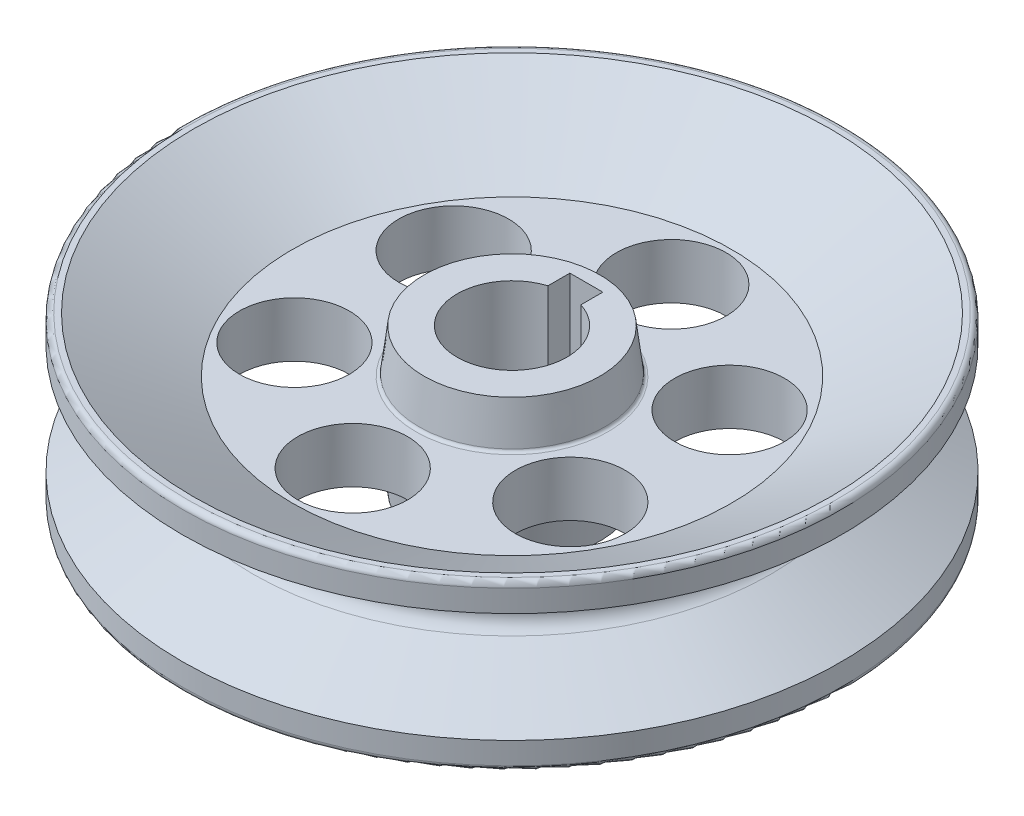
ISO-10303-21;
HEADER;
FILE_DESCRIPTION(('STEP AP214'),'2;1');
FILE_NAME('part.step','',(''),(''),'','','');
FILE_SCHEMA(('AUTOMOTIVE_DESIGN { 1 0 10303 214 1 1 1 1 }'));
ENDSEC;
DATA;
#1=APPLICATION_CONTEXT('core data for automotive mechanical design processes');
#2=APPLICATION_PROTOCOL_DEFINITION('international standard','automotive_design',2000,#1);
#3=PRODUCT_CONTEXT('',#1,'mechanical');
#4=PRODUCT('Part','Part','',(#3));
#5=PRODUCT_RELATED_PRODUCT_CATEGORY('part','',(#4));
#6=PRODUCT_DEFINITION_FORMATION('','',#4);
#7=PRODUCT_DEFINITION_CONTEXT('part definition',#1,'design');
#8=PRODUCT_DEFINITION('design','',#6,#7);
#9=PRODUCT_DEFINITION_SHAPE('','',#8);
#10=(LENGTH_UNIT() NAMED_UNIT(*) SI_UNIT(.MILLI.,.METRE.));
#11=(NAMED_UNIT(*) PLANE_ANGLE_UNIT() SI_UNIT($,.RADIAN.));
#12=(NAMED_UNIT(*) SI_UNIT($,.STERADIAN.) SOLID_ANGLE_UNIT());
#13=UNCERTAINTY_MEASURE_WITH_UNIT(LENGTH_MEASURE(1.E-05),#10,'distance_accuracy_value','');
#14=(GEOMETRIC_REPRESENTATION_CONTEXT(3) GLOBAL_UNCERTAINTY_ASSIGNED_CONTEXT((#13)) GLOBAL_UNIT_ASSIGNED_CONTEXT((#10,
#11,#12)) REPRESENTATION_CONTEXT('',''));
#15=CARTESIAN_POINT('',(0.,0.,0.));
#16=DIRECTION('',(0.,0.,1.));
#17=DIRECTION('',(1.,0.,0.));
#18=AXIS2_PLACEMENT_3D('',#15,#16,#17);
#19=CARTESIAN_POINT('',(0.,-381.,0.));
#20=DIRECTION('',(0.,1.,0.));
#21=DIRECTION('',(0.,0.,1.));
#22=AXIS2_PLACEMENT_3D('',#19,#20,#21);
#23=CYLINDRICAL_SURFACE('',#22,254.);
#24=CARTESIAN_POINT('',(0.,330.2,0.));
#25=DIRECTION('',(0.,1.,0.));
#26=DIRECTION('',(0.,0.,1.));
#27=AXIS2_PLACEMENT_3D('',#24,#25,#26);
#28=CIRCLE('',#27,254.);
#29=CARTESIAN_POINT('',(76.2,330.2,-242.300557159904));
#30=VERTEX_POINT('',#29);
#31=CARTESIAN_POINT('',(-76.2,330.2,-242.300557159891));
#32=VERTEX_POINT('',#31);
#33=EDGE_CURVE('E86',#30,#32,#28,.F.);
#34=ORIENTED_EDGE('',*,*,#33,.F.);
#35=DIRECTION('',(0.,1.,0.));
#36=VECTOR('',#35,1.);
#37=CARTESIAN_POINT('',(76.1999999999998,-381.,-242.300557159904));
#38=LINE('',#37,#36);
#39=CARTESIAN_POINT('',(76.2,-330.2,-242.300557159891));
#40=VERTEX_POINT('',#39);
#41=EDGE_CURVE('E98',#40,#30,#38,.T.);
#42=ORIENTED_EDGE('',*,*,#41,.F.);
#43=CARTESIAN_POINT('',(0.,-330.2,1.33226762955019E-11));
#44=DIRECTION('',(0.,-1.,0.));
#45=DIRECTION('',(0.,0.,-1.));
#46=AXIS2_PLACEMENT_3D('',#43,#44,#45);
#47=CIRCLE('',#46,254.);
#48=CARTESIAN_POINT('',(-76.2,-330.2,-242.300557159878));
#49=VERTEX_POINT('',#48);
#50=EDGE_CURVE('E68',#49,#40,#47,.F.);
#51=ORIENTED_EDGE('',*,*,#50,.F.);
#52=DIRECTION('',(0.,1.,0.));
#53=VECTOR('',#52,1.);
#54=CARTESIAN_POINT('',(-76.2,-381.,-242.300557159891));
#55=LINE('',#54,#53);
#56=EDGE_CURVE('E100',#49,#32,#55,.T.);
#57=ORIENTED_EDGE('',*,*,#56,.T.);
#58=EDGE_LOOP('',(#34,#42,#51,#57));
#59=FACE_BOUND('',#58,.T.);
#60=ADVANCED_FACE('F45',(#59),#23,.F.);
#61=CARTESIAN_POINT('',(-76.2,-381.,-242.300557159891));
#62=DIRECTION('',(-1.,0.,0.));
#63=DIRECTION('',(0.,0.,1.));
#64=AXIS2_PLACEMENT_3D('',#61,#62,#63);
#65=PLANE('',#64);
#66=DIRECTION('',(0.,0.,-1.));
#67=VECTOR('',#66,1.);
#68=CARTESIAN_POINT('',(-76.2,330.2,-242.300557159891));
#69=LINE('',#68,#67);
#70=CARTESIAN_POINT('',(-76.2,330.2,-343.900557159904));
#71=VERTEX_POINT('',#70);
#72=EDGE_CURVE('E102',#32,#71,#69,.T.);
#73=ORIENTED_EDGE('',*,*,#72,.F.);
#74=ORIENTED_EDGE('',*,*,#56,.F.);
#75=DIRECTION('',(0.,0.,1.));
#76=VECTOR('',#75,1.);
#77=CARTESIAN_POINT('',(-76.2,-330.2,-242.300557159878));
#78=LINE('',#77,#76);
#79=CARTESIAN_POINT('',(-76.1999999999998,-330.199999999993,-343.900557159904));
#80=VERTEX_POINT('',#79);
#81=EDGE_CURVE('E109',#80,#49,#78,.T.);
#82=ORIENTED_EDGE('',*,*,#81,.F.);
#83=DIRECTION('',(0.,1.,0.));
#84=VECTOR('',#83,1.);
#85=CARTESIAN_POINT('',(-76.2,-380.999999999993,-343.900557159904));
#86=LINE('',#85,#84);
#87=EDGE_CURVE('E107',#80,#71,#86,.T.);
#88=ORIENTED_EDGE('',*,*,#87,.T.);
#89=EDGE_LOOP('',(#73,#74,#82,#88));
#90=FACE_BOUND('',#89,.T.);
#91=ADVANCED_FACE('F156',(#90),#65,.F.);
#92=CARTESIAN_POINT('',(-76.2,-380.999999999993,-343.900557159904));
#93=DIRECTION('',(0.,0.,-1.));
#94=DIRECTION('',(-1.,0.,0.));
#95=AXIS2_PLACEMENT_3D('',#92,#93,#94);
#96=PLANE('',#95);
#97=DIRECTION('',(1.,0.,0.));
#98=VECTOR('',#97,1.);
#99=CARTESIAN_POINT('',(-76.2,330.2,-343.900557159904));
#100=LINE('',#99,#98);
#101=CARTESIAN_POINT('',(76.2,330.2,-343.900557159877));
#102=VERTEX_POINT('',#101);
#103=EDGE_CURVE('E60',#71,#102,#100,.T.);
#104=ORIENTED_EDGE('',*,*,#103,.F.);
#105=ORIENTED_EDGE('',*,*,#87,.F.);
#106=DIRECTION('',(-1.,0.,0.));
#107=VECTOR('',#106,1.);
#108=CARTESIAN_POINT('',(-76.1999999999998,-330.199999999993,-343.900557159904));
#109=LINE('',#108,#107);
#110=CARTESIAN_POINT('',(76.2,-330.199999999994,-343.900557159903));
#111=VERTEX_POINT('',#110);
#112=EDGE_CURVE('E247',#111,#80,#109,.T.);
#113=ORIENTED_EDGE('',*,*,#112,.F.);
#114=DIRECTION('',(0.,1.,0.));
#115=VECTOR('',#114,1.);
#116=CARTESIAN_POINT('',(76.2,-380.999999999993,-343.900557159904));
#117=LINE('',#116,#115);
#118=EDGE_CURVE('E105',#111,#102,#117,.T.);
#119=ORIENTED_EDGE('',*,*,#118,.T.);
#120=EDGE_LOOP('',(#104,#105,#113,#119));
#121=FACE_BOUND('',#120,.T.);
#122=ADVANCED_FACE('F161',(#121),#96,.F.);
#123=CARTESIAN_POINT('',(76.2,-380.999999999993,-343.900557159904));
#124=DIRECTION('',(1.,0.,0.));
#125=DIRECTION('',(0.,0.,-1.));
#126=AXIS2_PLACEMENT_3D('',#123,#124,#125);
#127=PLANE('',#126);
#128=DIRECTION('',(0.,0.,1.));
#129=VECTOR('',#128,1.);
#130=CARTESIAN_POINT('',(76.2,330.2,-343.900557159877));
#131=LINE('',#130,#129);
#132=EDGE_CURVE('E83',#102,#30,#131,.T.);
#133=ORIENTED_EDGE('',*,*,#132,.F.);
#134=ORIENTED_EDGE('',*,*,#118,.F.);
#135=DIRECTION('',(0.,0.,-1.));
#136=VECTOR('',#135,1.);
#137=CARTESIAN_POINT('',(76.2,-330.199999999994,-343.900557159903));
#138=LINE('',#137,#136);
#139=EDGE_CURVE('E93',#40,#111,#138,.T.);
#140=ORIENTED_EDGE('',*,*,#139,.F.);
#141=ORIENTED_EDGE('',*,*,#41,.T.);
#142=EDGE_LOOP('',(#133,#134,#140,#141));
#143=FACE_BOUND('',#142,.T.);
#144=ADVANCED_FACE('F104',(#143),#127,.F.);
#145=CARTESIAN_POINT('',(0.,-381.,-736.599999999999));
#146=DIRECTION('',(0.,1.,0.));
#147=DIRECTION('',(0.,0.,1.));
#148=AXIS2_PLACEMENT_3D('',#145,#146,#147);
#149=CYLINDRICAL_SURFACE('',#148,254.);
#150=CARTESIAN_POINT('',(0.,-127.,-736.6));
#151=DIRECTION('',(0.,-1.,0.));
#152=DIRECTION('',(0.,0.,-1.));
#153=AXIS2_PLACEMENT_3D('',#150,#151,#152);
#154=CIRCLE('',#153,254.);
#155=CARTESIAN_POINT('',(0.,-127.,-990.6));
#156=VERTEX_POINT('',#155);
#157=EDGE_CURVE('E249',#156,#156,#154,.F.);
#158=ORIENTED_EDGE('',*,*,#157,.F.);
#159=EDGE_LOOP('',(#158));
#160=FACE_BOUND('',#159,.T.);
#161=CARTESIAN_POINT('',(0.,127.,-736.599999999999));
#162=DIRECTION('',(0.,1.,0.));
#163=DIRECTION('',(0.,0.,1.));
#164=AXIS2_PLACEMENT_3D('',#161,#162,#163);
#165=CIRCLE('',#164,254.);
#166=CARTESIAN_POINT('',(0.,127.,-482.599999999999));
#167=VERTEX_POINT('',#166);
#168=EDGE_CURVE('E241',#167,#167,#165,.F.);
#169=ORIENTED_EDGE('',*,*,#168,.F.);
#170=EDGE_LOOP('',(#169));
#171=FACE_BOUND('',#170,.T.);
#172=ADVANCED_FACE('F229',(#160,#171),#149,.F.);
#173=CARTESIAN_POINT('',(-637.914312427618,-381.,-368.299999999998));
#174=DIRECTION('',(0.,1.,0.));
#175=DIRECTION('',(0.,0.,1.));
#176=AXIS2_PLACEMENT_3D('',#173,#174,#175);
#177=CYLINDRICAL_SURFACE('',#176,254.);
#178=CARTESIAN_POINT('',(-637.914312427618,-127.,-368.299999999997));
#179=DIRECTION('',(0.,-1.,0.));
#180=DIRECTION('',(0.,0.,-1.));
#181=AXIS2_PLACEMENT_3D('',#178,#179,#180);
#182=CIRCLE('',#181,254.);
#183=CARTESIAN_POINT('',(-637.914312427618,-127.,-622.299999999997));
#184=VERTEX_POINT('',#183);
#185=EDGE_CURVE('E252',#184,#184,#182,.F.);
#186=ORIENTED_EDGE('',*,*,#185,.F.);
#187=EDGE_LOOP('',(#186));
#188=FACE_BOUND('',#187,.T.);
#189=CARTESIAN_POINT('',(-637.914312427618,127.,-368.299999999998));
#190=DIRECTION('',(0.,1.,0.));
#191=DIRECTION('',(0.,0.,1.));
#192=AXIS2_PLACEMENT_3D('',#189,#190,#191);
#193=CIRCLE('',#192,254.);
#194=CARTESIAN_POINT('',(-637.914312427618,127.,-114.299999999998));
#195=VERTEX_POINT('',#194);
#196=EDGE_CURVE('E279',#195,#195,#193,.F.);
#197=ORIENTED_EDGE('',*,*,#196,.F.);
#198=EDGE_LOOP('',(#197));
#199=FACE_BOUND('',#198,.T.);
#200=ADVANCED_FACE('F225',(#188,#199),#177,.F.);
#201=CARTESIAN_POINT('',(637.914312427613,-381.,-368.300000000007));
#202=DIRECTION('',(0.,1.,0.));
#203=DIRECTION('',(0.,0.,1.));
#204=AXIS2_PLACEMENT_3D('',#201,#202,#203);
#205=CYLINDRICAL_SURFACE('',#204,254.);
#206=CARTESIAN_POINT('',(637.914312427613,-127.,-368.300000000006));
#207=DIRECTION('',(0.,-1.,0.));
#208=DIRECTION('',(0.,0.,-1.));
#209=AXIS2_PLACEMENT_3D('',#206,#207,#208);
#210=CIRCLE('',#209,254.);
#211=CARTESIAN_POINT('',(637.914312427613,-127.,-622.300000000006));
#212=VERTEX_POINT('',#211);
#213=EDGE_CURVE('E255',#212,#212,#210,.F.);
#214=ORIENTED_EDGE('',*,*,#213,.F.);
#215=EDGE_LOOP('',(#214));
#216=FACE_BOUND('',#215,.T.);
#217=CARTESIAN_POINT('',(637.914312427613,127.,-368.300000000007));
#218=DIRECTION('',(0.,1.,0.));
#219=DIRECTION('',(0.,0.,1.));
#220=AXIS2_PLACEMENT_3D('',#217,#218,#219);
#221=CIRCLE('',#220,254.);
#222=CARTESIAN_POINT('',(637.914312427613,127.,-114.300000000007));
#223=VERTEX_POINT('',#222);
#224=EDGE_CURVE('E282',#223,#223,#221,.F.);
#225=ORIENTED_EDGE('',*,*,#224,.F.);
#226=EDGE_LOOP('',(#225));
#227=FACE_BOUND('',#226,.T.);
#228=ADVANCED_FACE('F221',(#216,#227),#205,.F.);
#229=CARTESIAN_POINT('',(637.914312427621,-381.,368.299999999994));
#230=DIRECTION('',(0.,1.,0.));
#231=DIRECTION('',(0.,0.,1.));
#232=AXIS2_PLACEMENT_3D('',#229,#230,#231);
#233=CYLINDRICAL_SURFACE('',#232,254.);
#234=CARTESIAN_POINT('',(637.914312427621,-127.,368.299999999994));
#235=DIRECTION('',(0.,-1.,0.));
#236=DIRECTION('',(0.,0.,-1.));
#237=AXIS2_PLACEMENT_3D('',#234,#235,#236);
#238=CIRCLE('',#237,254.);
#239=CARTESIAN_POINT('',(637.914312427621,-127.,114.299999999994));
#240=VERTEX_POINT('',#239);
#241=EDGE_CURVE('E258',#240,#240,#238,.F.);
#242=ORIENTED_EDGE('',*,*,#241,.F.);
#243=EDGE_LOOP('',(#242));
#244=FACE_BOUND('',#243,.T.);
#245=CARTESIAN_POINT('',(637.914312427621,127.,368.299999999994));
#246=DIRECTION('',(0.,1.,0.));
#247=DIRECTION('',(0.,0.,1.));
#248=AXIS2_PLACEMENT_3D('',#245,#246,#247);
#249=CIRCLE('',#248,254.);
#250=CARTESIAN_POINT('',(637.914312427621,127.,622.299999999994));
#251=VERTEX_POINT('',#250);
#252=EDGE_CURVE('E285',#251,#251,#249,.F.);
#253=ORIENTED_EDGE('',*,*,#252,.F.);
#254=EDGE_LOOP('',(#253));
#255=FACE_BOUND('',#254,.T.);
#256=ADVANCED_FACE('F217',(#244,#255),#233,.F.);
#257=CARTESIAN_POINT('',(0.,-381.,736.6));
#258=DIRECTION('',(0.,1.,0.));
#259=DIRECTION('',(0.,0.,1.));
#260=AXIS2_PLACEMENT_3D('',#257,#258,#259);
#261=CYLINDRICAL_SURFACE('',#260,254.);
#262=CARTESIAN_POINT('',(0.,-127.,736.6));
#263=DIRECTION('',(0.,-1.,0.));
#264=DIRECTION('',(0.,0.,-1.));
#265=AXIS2_PLACEMENT_3D('',#262,#263,#264);
#266=CIRCLE('',#265,254.);
#267=CARTESIAN_POINT('',(0.,-127.,482.6));
#268=VERTEX_POINT('',#267);
#269=EDGE_CURVE('E128',#268,#268,#266,.F.);
#270=ORIENTED_EDGE('',*,*,#269,.F.);
#271=EDGE_LOOP('',(#270));
#272=FACE_BOUND('',#271,.T.);
#273=CARTESIAN_POINT('',(0.,127.,736.6));
#274=DIRECTION('',(0.,1.,0.));
#275=DIRECTION('',(0.,0.,1.));
#276=AXIS2_PLACEMENT_3D('',#273,#274,#275);
#277=CIRCLE('',#276,254.);
#278=CARTESIAN_POINT('',(0.,127.,990.6));
#279=VERTEX_POINT('',#278);
#280=EDGE_CURVE('E133',#279,#279,#277,.F.);
#281=ORIENTED_EDGE('',*,*,#280,.F.);
#282=EDGE_LOOP('',(#281));
#283=FACE_BOUND('',#282,.T.);
#284=ADVANCED_FACE('F194',(#272,#283),#261,.F.);
#285=CARTESIAN_POINT('',(-637.914312427616,-381.,368.300000000003));
#286=DIRECTION('',(0.,1.,0.));
#287=DIRECTION('',(0.,0.,1.));
#288=AXIS2_PLACEMENT_3D('',#285,#286,#287);
#289=CYLINDRICAL_SURFACE('',#288,254.);
#290=CARTESIAN_POINT('',(-637.914312427616,-127.,368.300000000003));
#291=DIRECTION('',(0.,-1.,0.));
#292=DIRECTION('',(0.,0.,-1.));
#293=AXIS2_PLACEMENT_3D('',#290,#291,#292);
#294=CIRCLE('',#293,254.);
#295=CARTESIAN_POINT('',(-637.914312427616,-127.,114.300000000003));
#296=VERTEX_POINT('',#295);
#297=EDGE_CURVE('E125',#296,#296,#294,.F.);
#298=ORIENTED_EDGE('',*,*,#297,.F.);
#299=EDGE_LOOP('',(#298));
#300=FACE_BOUND('',#299,.T.);
#301=CARTESIAN_POINT('',(-637.914312427616,127.,368.300000000003));
#302=DIRECTION('',(0.,1.,0.));
#303=DIRECTION('',(0.,0.,1.));
#304=AXIS2_PLACEMENT_3D('',#301,#302,#303);
#305=CIRCLE('',#304,254.);
#306=CARTESIAN_POINT('',(-637.914312427616,127.,622.300000000003));
#307=VERTEX_POINT('',#306);
#308=EDGE_CURVE('E131',#307,#307,#305,.F.);
#309=ORIENTED_EDGE('',*,*,#308,.F.);
#310=EDGE_LOOP('',(#309));
#311=FACE_BOUND('',#310,.T.);
#312=ADVANCED_FACE('F189',(#300,#311),#289,.F.);
#313=CARTESIAN_POINT('',(0.,381.,0.));
#314=DIRECTION('',(0.,-1.,0.));
#315=DIRECTION('',(0.,0.,-1.));
#316=AXIS2_PLACEMENT_3D('',#313,#314,#315);
#317=CYLINDRICAL_SURFACE('',#316,1524.);
#318=CARTESIAN_POINT('',(0.,355.6,1.33226762955019E-11));
#319=DIRECTION('',(0.,1.,0.));
#320=DIRECTION('',(0.,0.,1.));
#321=AXIS2_PLACEMENT_3D('',#318,#319,#320);
#322=CIRCLE('',#321,1524.);
#323=CARTESIAN_POINT('',(0.,355.6,1524.00000000001));
#324=VERTEX_POINT('',#323);
#325=EDGE_CURVE('E138',#324,#324,#322,.F.);
#326=ORIENTED_EDGE('',*,*,#325,.T.);
#327=EDGE_LOOP('',(#326));
#328=FACE_BOUND('',#327,.T.);
#329=CARTESIAN_POINT('',(0.,254.,0.));
#330=DIRECTION('',(0.,1.,0.));
#331=DIRECTION('',(0.,0.,1.));
#332=AXIS2_PLACEMENT_3D('',#329,#330,#331);
#333=CIRCLE('',#332,1524.);
#334=CARTESIAN_POINT('',(0.,254.,1524.));
#335=VERTEX_POINT('',#334);
#336=EDGE_CURVE('E113',#335,#335,#333,.T.);
#337=ORIENTED_EDGE('',*,*,#336,.T.);
#338=EDGE_LOOP('',(#337));
#339=FACE_BOUND('',#338,.T.);
#340=ADVANCED_FACE('F183',(#328,#339),#317,.T.);
#341=CARTESIAN_POINT('',(0.,381.,0.));
#342=DIRECTION('',(0.,1.,0.));
#343=DIRECTION('',(0.,0.,1.));
#344=AXIS2_PLACEMENT_3D('',#341,#342,#343);
#345=PLANE('',#344);
#346=CARTESIAN_POINT('',(0.,381.,0.));
#347=DIRECTION('',(0.,1.,0.));
#348=DIRECTION('',(0.,0.,1.));
#349=AXIS2_PLACEMENT_3D('',#346,#347,#348);
#350=CIRCLE('',#349,1498.6);
#351=CARTESIAN_POINT('',(0.,381.,1498.6));
#352=VERTEX_POINT('',#351);
#353=EDGE_CURVE('E92',#352,#352,#350,.T.);
#354=ORIENTED_EDGE('',*,*,#353,.T.);
#355=EDGE_LOOP('',(#354));
#356=FACE_BOUND('',#355,.T.);
#357=CARTESIAN_POINT('',(0.,381.,0.));
#358=DIRECTION('',(0.,1.,0.));
#359=DIRECTION('',(0.,0.,1.));
#360=AXIS2_PLACEMENT_3D('',#357,#358,#359);
#361=CIRCLE('',#360,1473.2);
#362=CARTESIAN_POINT('',(0.,381.,1473.2));
#363=VERTEX_POINT('',#362);
#364=EDGE_CURVE('E295',#363,#363,#361,.T.);
#365=ORIENTED_EDGE('',*,*,#364,.F.);
#366=EDGE_LOOP('',(#365));
#367=FACE_BOUND('',#366,.T.);
#368=ADVANCED_FACE('F179',(#356,#367),#345,.T.);
#369=CARTESIAN_POINT('',(0.,254.,0.));
#370=DIRECTION('',(0.,1.,0.));
#371=DIRECTION('',(0.,0.,1.));
#372=AXIS2_PLACEMENT_3D('',#369,#370,#371);
#373=CONICAL_SURFACE('',#372,1524.,1.0471975511966);
#374=CARTESIAN_POINT('',(0.,65.9911357683741,0.));
#375=DIRECTION('',(0.,1.,0.));
#376=DIRECTION('',(0.,0.,1.));
#377=AXIS2_PLACEMENT_3D('',#374,#375,#376);
#378=CIRCLE('',#377,1198.35909487751);
#379=CARTESIAN_POINT('',(0.,65.9911357683741,1198.35909487751));
#380=VERTEX_POINT('',#379);
#381=EDGE_CURVE('E122',#380,#380,#378,.T.);
#382=ORIENTED_EDGE('',*,*,#381,.T.);
#383=EDGE_LOOP('',(#382));
#384=FACE_BOUND('',#383,.T.);
#385=ORIENTED_EDGE('',*,*,#336,.F.);
#386=EDGE_LOOP('',(#385));
#387=FACE_BOUND('',#386,.T.);
#388=ADVANCED_FACE('F175',(#384,#387),#373,.T.);
#389=CARTESIAN_POINT('',(0.,0.,0.));
#390=DIRECTION('',(0.,1.,0.));
#391=DIRECTION('',(0.,0.,1.));
#392=AXIS2_PLACEMENT_3D('',#389,#390,#391);
#393=TOROIDAL_SURFACE('',#392,1236.45909487751,76.2);
#394=CARTESIAN_POINT('',(0.,-65.9911357683741,1.33226762955019E-11));
#395=DIRECTION('',(0.,1.,0.));
#396=DIRECTION('',(0.,0.,1.));
#397=AXIS2_PLACEMENT_3D('',#394,#395,#396);
#398=CIRCLE('',#397,1198.35909487751);
#399=CARTESIAN_POINT('',(0.,-65.9911357683741,1198.35909487752));
#400=VERTEX_POINT('',#399);
#401=EDGE_CURVE('E119',#400,#400,#398,.T.);
#402=ORIENTED_EDGE('',*,*,#401,.T.);
#403=EDGE_LOOP('',(#402));
#404=FACE_BOUND('',#403,.T.);
#405=ORIENTED_EDGE('',*,*,#381,.F.);
#406=EDGE_LOOP('',(#405));
#407=FACE_BOUND('',#406,.T.);
#408=ADVANCED_FACE('F171',(#404,#407),#393,.F.);
#409=CARTESIAN_POINT('',(0.,-65.9911357683741,1.33226762955019E-11));
#410=DIRECTION('',(0.,-1.,0.));
#411=DIRECTION('',(0.,0.,-1.));
#412=AXIS2_PLACEMENT_3D('',#409,#410,#411);
#413=CONICAL_SURFACE('',#412,1198.35909487751,1.0471975511966);
#414=CARTESIAN_POINT('',(0.,-254.,0.));
#415=DIRECTION('',(0.,1.,0.));
#416=DIRECTION('',(0.,0.,1.));
#417=AXIS2_PLACEMENT_3D('',#414,#415,#416);
#418=CIRCLE('',#417,1524.);
#419=CARTESIAN_POINT('',(0.,-254.,1524.));
#420=VERTEX_POINT('',#419);
#421=EDGE_CURVE('E116',#420,#420,#418,.T.);
#422=ORIENTED_EDGE('',*,*,#421,.T.);
#423=EDGE_LOOP('',(#422));
#424=FACE_BOUND('',#423,.T.);
#425=ORIENTED_EDGE('',*,*,#401,.F.);
#426=EDGE_LOOP('',(#425));
#427=FACE_BOUND('',#426,.T.);
#428=ADVANCED_FACE('F167',(#424,#427),#413,.T.);
#429=CARTESIAN_POINT('',(0.,-381.,0.));
#430=DIRECTION('',(0.,1.,0.));
#431=DIRECTION('',(0.,0.,1.));
#432=AXIS2_PLACEMENT_3D('',#429,#430,#431);
#433=PLANE('',#432);
#434=CARTESIAN_POINT('',(0.,-381.,0.));
#435=DIRECTION('',(0.,1.,0.));
#436=DIRECTION('',(0.,0.,1.));
#437=AXIS2_PLACEMENT_3D('',#434,#435,#436);
#438=CIRCLE('',#437,1498.6);
#439=CARTESIAN_POINT('',(0.,-381.,1498.6));
#440=VERTEX_POINT('',#439);
#441=EDGE_CURVE('E12',#440,#440,#438,.F.);
#442=ORIENTED_EDGE('',*,*,#441,.T.);
#443=EDGE_LOOP('',(#442));
#444=FACE_BOUND('',#443,.T.);
#445=CARTESIAN_POINT('',(0.,-381.,0.));
#446=DIRECTION('',(0.,1.,0.));
#447=DIRECTION('',(0.,0.,1.));
#448=AXIS2_PLACEMENT_3D('',#445,#446,#447);
#449=CIRCLE('',#448,1473.2);
#450=CARTESIAN_POINT('',(0.,-381.,1473.2));
#451=VERTEX_POINT('',#450);
#452=EDGE_CURVE('E129',#451,#451,#449,.T.);
#453=ORIENTED_EDGE('',*,*,#452,.T.);
#454=EDGE_LOOP('',(#453));
#455=FACE_BOUND('',#454,.T.);
#456=ADVANCED_FACE('F170',(#444,#455),#433,.F.);
#457=CARTESIAN_POINT('',(0.,-355.6,0.));
#458=DIRECTION('',(0.,1.,0.));
#459=DIRECTION('',(0.,0.,1.));
#460=AXIS2_PLACEMENT_3D('',#457,#458,#459);
#461=CIRCLE('',#460,1524.);
#462=CARTESIAN_POINT('',(0.,-355.6,1524.));
#463=VERTEX_POINT('',#462);
#464=EDGE_CURVE('E53',#463,#463,#461,.T.);
#465=ORIENTED_EDGE('',*,*,#464,.T.);
#466=EDGE_LOOP('',(#465));
#467=FACE_BOUND('',#466,.T.);
#468=ORIENTED_EDGE('',*,*,#421,.F.);
#469=EDGE_LOOP('',(#468));
#470=FACE_BOUND('',#469,.T.);
#471=ADVANCED_FACE('F143',(#467,#470),#317,.T.);
#472=CARTESIAN_POINT('',(0.,-330.2,1.33226762955019E-11));
#473=DIRECTION('',(0.,-1.,0.));
#474=DIRECTION('',(0.,0.,-1.));
#475=AXIS2_PLACEMENT_3D('',#472,#473,#474);
#476=PLANE('',#475);
#477=CARTESIAN_POINT('',(0.,-330.2,1.33226762955019E-11));
#478=DIRECTION('',(0.,1.,0.));
#479=DIRECTION('',(0.,0.,1.));
#480=AXIS2_PLACEMENT_3D('',#477,#478,#479);
#481=CIRCLE('',#480,406.4);
#482=CARTESIAN_POINT('',(0.,-330.2,406.400000000013));
#483=VERTEX_POINT('',#482);
#484=EDGE_CURVE('E101',#483,#483,#481,.T.);
#485=ORIENTED_EDGE('',*,*,#484,.F.);
#486=EDGE_LOOP('',(#485));
#487=FACE_BOUND('',#486,.T.);
#488=ORIENTED_EDGE('',*,*,#50,.T.);
#489=ORIENTED_EDGE('',*,*,#139,.T.);
#490=ORIENTED_EDGE('',*,*,#112,.T.);
#491=ORIENTED_EDGE('',*,*,#81,.T.);
#492=EDGE_LOOP('',(#488,#489,#490,#491));
#493=FACE_BOUND('',#492,.T.);
#494=ADVANCED_FACE('F199',(#487,#493),#476,.T.);
#495=CARTESIAN_POINT('',(0.,-127.,-1016.));
#496=DIRECTION('',(0.,-1.,0.));
#497=DIRECTION('',(0.,0.,-1.));
#498=AXIS2_PLACEMENT_3D('',#495,#496,#497);
#499=PLANE('',#498);
#500=CARTESIAN_POINT('',(0.,-127.,0.));
#501=DIRECTION('',(0.,1.,0.));
#502=DIRECTION('',(0.,0.,1.));
#503=AXIS2_PLACEMENT_3D('',#500,#501,#502);
#504=CIRCLE('',#503,444.5);
#505=CARTESIAN_POINT('',(0.,-127.,444.5));
#506=VERTEX_POINT('',#505);
#507=EDGE_CURVE('E268',#506,#506,#504,.T.);
#508=ORIENTED_EDGE('',*,*,#507,.T.);
#509=EDGE_LOOP('',(#508));
#510=FACE_BOUND('',#509,.T.);
#511=CARTESIAN_POINT('',(0.,-127.,0.));
#512=DIRECTION('',(0.,1.,0.));
#513=DIRECTION('',(0.,0.,1.));
#514=AXIS2_PLACEMENT_3D('',#511,#512,#513);
#515=CIRCLE('',#514,1016.);
#516=CARTESIAN_POINT('',(0.,-127.,1016.));
#517=VERTEX_POINT('',#516);
#518=EDGE_CURVE('E265',#517,#517,#515,.T.);
#519=ORIENTED_EDGE('',*,*,#518,.F.);
#520=EDGE_LOOP('',(#519));
#521=FACE_BOUND('',#520,.T.);
#522=ORIENTED_EDGE('',*,*,#297,.T.);
#523=EDGE_LOOP('',(#522));
#524=FACE_BOUND('',#523,.T.);
#525=ORIENTED_EDGE('',*,*,#269,.T.);
#526=EDGE_LOOP('',(#525));
#527=FACE_BOUND('',#526,.T.);
#528=ORIENTED_EDGE('',*,*,#241,.T.);
#529=EDGE_LOOP('',(#528));
#530=FACE_BOUND('',#529,.T.);
#531=ORIENTED_EDGE('',*,*,#213,.T.);
#532=EDGE_LOOP('',(#531));
#533=FACE_BOUND('',#532,.T.);
#534=ORIENTED_EDGE('',*,*,#185,.T.);
#535=EDGE_LOOP('',(#534));
#536=FACE_BOUND('',#535,.T.);
#537=ORIENTED_EDGE('',*,*,#157,.T.);
#538=EDGE_LOOP('',(#537));
#539=FACE_BOUND('',#538,.T.);
#540=ADVANCED_FACE('F203',(#510,#521,#524,#527,#530,#533,#536,#539),#499,.T.);
#541=CARTESIAN_POINT('',(0.,-381.,0.));
#542=DIRECTION('',(0.,-1.,0.));
#543=DIRECTION('',(0.,0.,-1.));
#544=AXIS2_PLACEMENT_3D('',#541,#542,#543);
#545=CONICAL_SURFACE('',#544,1473.2,1.06369782240256);
#546=ORIENTED_EDGE('',*,*,#518,.T.);
#547=EDGE_LOOP('',(#546));
#548=FACE_BOUND('',#547,.T.);
#549=ORIENTED_EDGE('',*,*,#452,.F.);
#550=EDGE_LOOP('',(#549));
#551=FACE_BOUND('',#550,.T.);
#552=ADVANCED_FACE('F209',(#548,#551),#545,.F.);
#553=CARTESIAN_POINT('',(0.,-141.47353357562,0.));
#554=DIRECTION('',(0.,1.,0.));
#555=DIRECTION('',(0.,0.,1.));
#556=AXIS2_PLACEMENT_3D('',#553,#554,#555);
#557=TOROIDAL_SURFACE('',#556,444.5,14.4735335756199);
#558=CARTESIAN_POINT('',(0.,-139.684026624641,0.));
#559=DIRECTION('',(0.,1.,0.));
#560=DIRECTION('',(0.,0.,1.));
#561=AXIS2_PLACEMENT_3D('',#558,#559,#560);
#562=CIRCLE('',#561,430.137519746332);
#563=CARTESIAN_POINT('',(0.,-139.684026624641,430.137519746332));
#564=VERTEX_POINT('',#563);
#565=EDGE_CURVE('E271',#564,#564,#562,.T.);
#566=ORIENTED_EDGE('',*,*,#565,.T.);
#567=EDGE_LOOP('',(#566));
#568=FACE_BOUND('',#567,.T.);
#569=ORIENTED_EDGE('',*,*,#507,.F.);
#570=EDGE_LOOP('',(#569));
#571=FACE_BOUND('',#570,.T.);
#572=ADVANCED_FACE('F348',(#568,#571),#557,.F.);
#573=CARTESIAN_POINT('',(0.,-139.684026624641,0.));
#574=DIRECTION('',(0.,1.,0.));
#575=DIRECTION('',(0.,0.,1.));
#576=AXIS2_PLACEMENT_3D('',#573,#574,#575);
#577=CONICAL_SURFACE('',#576,430.137519746332,0.123957146381599);
#578=ORIENTED_EDGE('',*,*,#484,.T.);
#579=EDGE_LOOP('',(#578));
#580=FACE_BOUND('',#579,.T.);
#581=ORIENTED_EDGE('',*,*,#565,.F.);
#582=EDGE_LOOP('',(#581));
#583=FACE_BOUND('',#582,.T.);
#584=ADVANCED_FACE('F336',(#580,#583),#577,.T.);
#585=CARTESIAN_POINT('',(0.,330.2,0.));
#586=DIRECTION('',(0.,1.,0.));
#587=DIRECTION('',(0.,0.,1.));
#588=AXIS2_PLACEMENT_3D('',#585,#586,#587);
#589=PLANE('',#588);
#590=CARTESIAN_POINT('',(0.,330.2,0.));
#591=DIRECTION('',(0.,1.,0.));
#592=DIRECTION('',(0.,0.,1.));
#593=AXIS2_PLACEMENT_3D('',#590,#591,#592);
#594=CIRCLE('',#593,406.4);
#595=CARTESIAN_POINT('',(0.,330.2,406.4));
#596=VERTEX_POINT('',#595);
#597=EDGE_CURVE('E292',#596,#596,#594,.T.);
#598=ORIENTED_EDGE('',*,*,#597,.T.);
#599=EDGE_LOOP('',(#598));
#600=FACE_BOUND('',#599,.T.);
#601=ORIENTED_EDGE('',*,*,#33,.T.);
#602=ORIENTED_EDGE('',*,*,#72,.T.);
#603=ORIENTED_EDGE('',*,*,#103,.T.);
#604=ORIENTED_EDGE('',*,*,#132,.T.);
#605=EDGE_LOOP('',(#601,#602,#603,#604));
#606=FACE_BOUND('',#605,.T.);
#607=ADVANCED_FACE('F85',(#600,#606),#589,.T.);
#608=CARTESIAN_POINT('',(0.,127.,-1016.));
#609=DIRECTION('',(0.,1.,0.));
#610=DIRECTION('',(0.,0.,1.));
#611=AXIS2_PLACEMENT_3D('',#608,#609,#610);
#612=PLANE('',#611);
#613=CARTESIAN_POINT('',(0.,127.,0.));
#614=DIRECTION('',(0.,1.,0.));
#615=DIRECTION('',(0.,0.,1.));
#616=AXIS2_PLACEMENT_3D('',#613,#614,#615);
#617=CIRCLE('',#616,1016.);
#618=CARTESIAN_POINT('',(0.,127.,1016.));
#619=VERTEX_POINT('',#618);
#620=EDGE_CURVE('E298',#619,#619,#617,.T.);
#621=ORIENTED_EDGE('',*,*,#620,.T.);
#622=EDGE_LOOP('',(#621));
#623=FACE_BOUND('',#622,.T.);
#624=CARTESIAN_POINT('',(0.,127.,0.));
#625=DIRECTION('',(0.,1.,0.));
#626=DIRECTION('',(0.,0.,1.));
#627=AXIS2_PLACEMENT_3D('',#624,#625,#626);
#628=CIRCLE('',#627,444.5);
#629=CARTESIAN_POINT('',(0.,127.,444.5));
#630=VERTEX_POINT('',#629);
#631=EDGE_CURVE('E301',#630,#630,#628,.T.);
#632=ORIENTED_EDGE('',*,*,#631,.F.);
#633=EDGE_LOOP('',(#632));
#634=FACE_BOUND('',#633,.T.);
#635=ORIENTED_EDGE('',*,*,#308,.T.);
#636=EDGE_LOOP('',(#635));
#637=FACE_BOUND('',#636,.T.);
#638=ORIENTED_EDGE('',*,*,#280,.T.);
#639=EDGE_LOOP('',(#638));
#640=FACE_BOUND('',#639,.T.);
#641=ORIENTED_EDGE('',*,*,#252,.T.);
#642=EDGE_LOOP('',(#641));
#643=FACE_BOUND('',#642,.T.);
#644=ORIENTED_EDGE('',*,*,#224,.T.);
#645=EDGE_LOOP('',(#644));
#646=FACE_BOUND('',#645,.T.);
#647=ORIENTED_EDGE('',*,*,#196,.T.);
#648=EDGE_LOOP('',(#647));
#649=FACE_BOUND('',#648,.T.);
#650=ORIENTED_EDGE('',*,*,#168,.T.);
#651=EDGE_LOOP('',(#650));
#652=FACE_BOUND('',#651,.T.);
#653=ADVANCED_FACE('F308',(#623,#634,#637,#640,#643,#646,#649,#652),#612,.T.);
#654=CARTESIAN_POINT('',(0.,141.47353357562,1.33226762955019E-11));
#655=DIRECTION('',(0.,1.,0.));
#656=DIRECTION('',(0.,0.,1.));
#657=AXIS2_PLACEMENT_3D('',#654,#655,#656);
#658=TOROIDAL_SURFACE('',#657,444.5,14.4735335756199);
#659=ORIENTED_EDGE('',*,*,#631,.T.);
#660=EDGE_LOOP('',(#659));
#661=FACE_BOUND('',#660,.T.);
#662=CARTESIAN_POINT('',(0.,139.684026624641,1.33226762955019E-11));
#663=DIRECTION('',(0.,1.,0.));
#664=DIRECTION('',(0.,0.,1.));
#665=AXIS2_PLACEMENT_3D('',#662,#663,#664);
#666=CIRCLE('',#665,430.137519746333);
#667=CARTESIAN_POINT('',(0.,139.684026624641,430.137519746346));
#668=VERTEX_POINT('',#667);
#669=EDGE_CURVE('E134',#668,#668,#666,.T.);
#670=ORIENTED_EDGE('',*,*,#669,.F.);
#671=EDGE_LOOP('',(#670));
#672=FACE_BOUND('',#671,.T.);
#673=ADVANCED_FACE('F305',(#661,#672),#658,.F.);
#674=CARTESIAN_POINT('',(0.,330.2,0.));
#675=DIRECTION('',(0.,-1.,0.));
#676=DIRECTION('',(0.,0.,-1.));
#677=AXIS2_PLACEMENT_3D('',#674,#675,#676);
#678=CONICAL_SURFACE('',#677,406.4,0.123957146381601);
#679=ORIENTED_EDGE('',*,*,#669,.T.);
#680=EDGE_LOOP('',(#679));
#681=FACE_BOUND('',#680,.T.);
#682=ORIENTED_EDGE('',*,*,#597,.F.);
#683=EDGE_LOOP('',(#682));
#684=FACE_BOUND('',#683,.T.);
#685=ADVANCED_FACE('F334',(#681,#684),#678,.T.);
#686=CARTESIAN_POINT('',(0.,127.,0.));
#687=DIRECTION('',(0.,1.,0.));
#688=DIRECTION('',(0.,0.,1.));
#689=AXIS2_PLACEMENT_3D('',#686,#687,#688);
#690=CONICAL_SURFACE('',#689,1016.,1.06369782240256);
#691=ORIENTED_EDGE('',*,*,#364,.T.);
#692=EDGE_LOOP('',(#691));
#693=FACE_BOUND('',#692,.T.);
#694=ORIENTED_EDGE('',*,*,#620,.F.);
#695=EDGE_LOOP('',(#694));
#696=FACE_BOUND('',#695,.T.);
#697=ADVANCED_FACE('F152',(#693,#696),#690,.F.);
#698=CARTESIAN_POINT('',(0.,355.6,1.33226762955019E-11));
#699=DIRECTION('',(0.,1.,0.));
#700=DIRECTION('',(0.,0.,1.));
#701=AXIS2_PLACEMENT_3D('',#698,#699,#700);
#702=TOROIDAL_SURFACE('',#701,1498.6,25.4);
#703=ORIENTED_EDGE('',*,*,#325,.F.);
#704=EDGE_LOOP('',(#703));
#705=FACE_BOUND('',#704,.T.);
#706=ORIENTED_EDGE('',*,*,#353,.F.);
#707=EDGE_LOOP('',(#706));
#708=FACE_BOUND('',#707,.T.);
#709=ADVANCED_FACE('F147',(#705,#708),#702,.T.);
#710=CARTESIAN_POINT('',(0.,-355.6,0.));
#711=DIRECTION('',(0.,1.,0.));
#712=DIRECTION('',(0.,0.,1.));
#713=AXIS2_PLACEMENT_3D('',#710,#711,#712);
#714=TOROIDAL_SURFACE('',#713,1498.6,25.4);
#715=ORIENTED_EDGE('',*,*,#441,.F.);
#716=EDGE_LOOP('',(#715));
#717=FACE_BOUND('',#716,.T.);
#718=ORIENTED_EDGE('',*,*,#464,.F.);
#719=EDGE_LOOP('',(#718));
#720=FACE_BOUND('',#719,.T.);
#721=ADVANCED_FACE('F47',(#717,#720),#714,.T.);
#722=CLOSED_SHELL('',(#60,#91,#122,#144,#172,#200,#228,#256,#284,#312,#340,#368,#388,#408,#428,
#456,#471,#494,#540,#552,#572,#584,#607,#653,#673,#685,#697,#709,#721));
#723=MANIFOLD_SOLID_BREP('B2',#722);
#724=ADVANCED_BREP_SHAPE_REPRESENTATION('',(#18,#723),#14);
#725=SHAPE_DEFINITION_REPRESENTATION(#9,#724);
ENDSEC;
END-ISO-10303-21;
